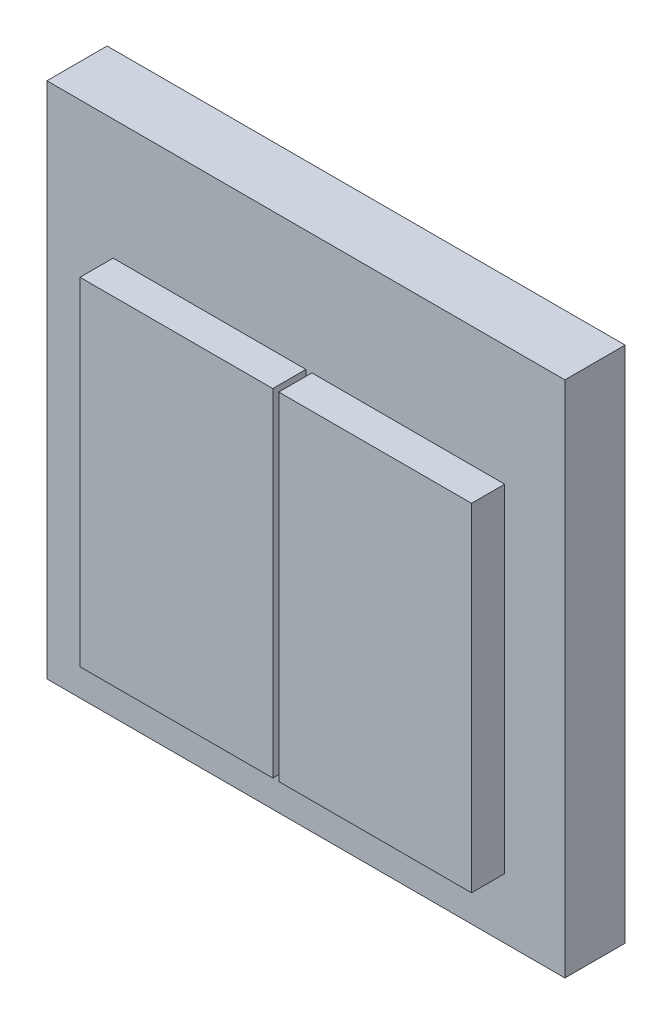
ISO-10303-21;
HEADER;
FILE_DESCRIPTION(('STEP AP214'),'2;1');
FILE_NAME('part.step','',(''),(''),'','','');
FILE_SCHEMA(('AUTOMOTIVE_DESIGN { 1 0 10303 214 1 1 1 1 }'));
ENDSEC;
DATA;
#1=APPLICATION_CONTEXT('core data for automotive mechanical design processes');
#2=APPLICATION_PROTOCOL_DEFINITION('international standard','automotive_design',2000,#1);
#3=PRODUCT_CONTEXT('',#1,'mechanical');
#4=PRODUCT('Part','Part','',(#3));
#5=PRODUCT_RELATED_PRODUCT_CATEGORY('part','',(#4));
#6=PRODUCT_DEFINITION_FORMATION('','',#4);
#7=PRODUCT_DEFINITION_CONTEXT('part definition',#1,'design');
#8=PRODUCT_DEFINITION('design','',#6,#7);
#9=PRODUCT_DEFINITION_SHAPE('','',#8);
#10=(LENGTH_UNIT() NAMED_UNIT(*) SI_UNIT(.MILLI.,.METRE.));
#11=(NAMED_UNIT(*) PLANE_ANGLE_UNIT() SI_UNIT($,.RADIAN.));
#12=(NAMED_UNIT(*) SI_UNIT($,.STERADIAN.) SOLID_ANGLE_UNIT());
#13=UNCERTAINTY_MEASURE_WITH_UNIT(LENGTH_MEASURE(1.E-05),#10,'distance_accuracy_value','');
#14=(GEOMETRIC_REPRESENTATION_CONTEXT(3) GLOBAL_UNCERTAINTY_ASSIGNED_CONTEXT((#13)) GLOBAL_UNIT_ASSIGNED_CONTEXT((#10,
#11,#12)) REPRESENTATION_CONTEXT('',''));
#15=CARTESIAN_POINT('',(0.,0.,0.));
#16=DIRECTION('',(0.,0.,1.));
#17=DIRECTION('',(1.,0.,0.));
#18=AXIS2_PLACEMENT_3D('',#15,#16,#17);
#19=CARTESIAN_POINT('',(0.,0.,0.));
#20=DIRECTION('',(0.,0.,1.));
#21=DIRECTION('',(1.,0.,0.));
#22=AXIS2_PLACEMENT_3D('',#19,#20,#21);
#23=PLANE('',#22);
#24=DIRECTION('',(0.,-1.,0.));
#25=VECTOR('',#24,1.);
#26=CARTESIAN_POINT('',(-43.,43.,0.));
#27=LINE('',#26,#25);
#28=CARTESIAN_POINT('',(-43.,43.,0.));
#29=VERTEX_POINT('',#28);
#30=CARTESIAN_POINT('',(-43.,-43.,0.));
#31=VERTEX_POINT('',#30);
#32=EDGE_CURVE('E179',#29,#31,#27,.T.);
#33=ORIENTED_EDGE('',*,*,#32,.T.);
#34=DIRECTION('',(1.,0.,0.));
#35=VECTOR('',#34,1.);
#36=CARTESIAN_POINT('',(-43.,-43.,0.));
#37=LINE('',#36,#35);
#38=CARTESIAN_POINT('',(43.,-43.,0.));
#39=VERTEX_POINT('',#38);
#40=EDGE_CURVE('E187',#31,#39,#37,.T.);
#41=ORIENTED_EDGE('',*,*,#40,.T.);
#42=DIRECTION('',(0.,1.,0.));
#43=VECTOR('',#42,1.);
#44=CARTESIAN_POINT('',(43.,43.,0.));
#45=LINE('',#44,#43);
#46=CARTESIAN_POINT('',(43.,43.,0.));
#47=VERTEX_POINT('',#46);
#48=EDGE_CURVE('E184',#39,#47,#45,.T.);
#49=ORIENTED_EDGE('',*,*,#48,.T.);
#50=DIRECTION('',(-1.,0.,0.));
#51=VECTOR('',#50,1.);
#52=CARTESIAN_POINT('',(-43.,43.,0.));
#53=LINE('',#52,#51);
#54=EDGE_CURVE('E180',#47,#29,#53,.T.);
#55=ORIENTED_EDGE('',*,*,#54,.T.);
#56=EDGE_LOOP('',(#33,#41,#49,#55));
#57=FACE_BOUND('',#56,.T.);
#58=DIRECTION('',(0.,-1.,0.));
#59=VECTOR('',#58,1.);
#60=CARTESIAN_POINT('',(-32.,-33.,0.));
#61=LINE('',#60,#59);
#62=CARTESIAN_POINT('',(-32.,23.,0.));
#63=VERTEX_POINT('',#62);
#64=CARTESIAN_POINT('',(-32.,-33.,0.));
#65=VERTEX_POINT('',#64);
#66=EDGE_CURVE('E151',#63,#65,#61,.T.);
#67=ORIENTED_EDGE('',*,*,#66,.F.);
#68=DIRECTION('',(-1.,0.,0.));
#69=VECTOR('',#68,1.);
#70=CARTESIAN_POINT('',(0.,23.,0.));
#71=LINE('',#70,#69);
#72=CARTESIAN_POINT('',(0.,23.,0.));
#73=VERTEX_POINT('',#72);
#74=EDGE_CURVE('E148',#73,#63,#71,.T.);
#75=ORIENTED_EDGE('',*,*,#74,.F.);
#76=DIRECTION('',(0.,1.,0.));
#77=VECTOR('',#76,1.);
#78=CARTESIAN_POINT('',(0.,23.,0.));
#79=LINE('',#78,#77);
#80=CARTESIAN_POINT('',(0.,-33.,0.));
#81=VERTEX_POINT('',#80);
#82=EDGE_CURVE('E160',#81,#73,#79,.T.);
#83=ORIENTED_EDGE('',*,*,#82,.F.);
#84=DIRECTION('',(1.,0.,0.));
#85=VECTOR('',#84,1.);
#86=CARTESIAN_POINT('',(0.,-33.,0.));
#87=LINE('',#86,#85);
#88=EDGE_CURVE('E168',#65,#81,#87,.T.);
#89=ORIENTED_EDGE('',*,*,#88,.F.);
#90=EDGE_LOOP('',(#67,#75,#83,#89));
#91=FACE_BOUND('',#90,.T.);
#92=DIRECTION('',(-1.,0.,0.));
#93=VECTOR('',#92,1.);
#94=CARTESIAN_POINT('',(33.,23.,0.));
#95=LINE('',#94,#93);
#96=CARTESIAN_POINT('',(33.,23.,0.));
#97=VERTEX_POINT('',#96);
#98=CARTESIAN_POINT('',(1.,23.,0.));
#99=VERTEX_POINT('',#98);
#100=EDGE_CURVE('E374',#97,#99,#95,.T.);
#101=ORIENTED_EDGE('',*,*,#100,.F.);
#102=DIRECTION('',(0.,1.,0.));
#103=VECTOR('',#102,1.);
#104=CARTESIAN_POINT('',(33.,-33.,0.));
#105=LINE('',#104,#103);
#106=CARTESIAN_POINT('',(33.,-33.,0.));
#107=VERTEX_POINT('',#106);
#108=EDGE_CURVE('E146',#107,#97,#105,.T.);
#109=ORIENTED_EDGE('',*,*,#108,.F.);
#110=DIRECTION('',(1.,0.,0.));
#111=VECTOR('',#110,1.);
#112=CARTESIAN_POINT('',(33.,-33.,0.));
#113=LINE('',#112,#111);
#114=CARTESIAN_POINT('',(1.,-33.,0.));
#115=VERTEX_POINT('',#114);
#116=EDGE_CURVE('E142',#115,#107,#113,.T.);
#117=ORIENTED_EDGE('',*,*,#116,.F.);
#118=DIRECTION('',(0.,-1.,0.));
#119=VECTOR('',#118,1.);
#120=CARTESIAN_POINT('',(1.,23.,0.));
#121=LINE('',#120,#119);
#122=EDGE_CURVE('E371',#99,#115,#121,.T.);
#123=ORIENTED_EDGE('',*,*,#122,.F.);
#124=EDGE_LOOP('',(#101,#109,#117,#123));
#125=FACE_BOUND('',#124,.T.);
#126=ADVANCED_FACE('F34',(#57,#91,#125),#23,.T.);
#127=CARTESIAN_POINT('',(0.,0.,-10.));
#128=DIRECTION('',(0.,0.,-1.));
#129=DIRECTION('',(-1.,0.,0.));
#130=AXIS2_PLACEMENT_3D('',#127,#128,#129);
#131=PLANE('',#130);
#132=DIRECTION('',(0.,-1.,0.));
#133=VECTOR('',#132,1.);
#134=CARTESIAN_POINT('',(-43.,43.,-9.99999999999999));
#135=LINE('',#134,#133);
#136=CARTESIAN_POINT('',(-43.,43.,-9.99999999999999));
#137=VERTEX_POINT('',#136);
#138=CARTESIAN_POINT('',(-43.,-43.,-9.99999999999999));
#139=VERTEX_POINT('',#138);
#140=EDGE_CURVE('E42',#137,#139,#135,.T.);
#141=ORIENTED_EDGE('',*,*,#140,.F.);
#142=DIRECTION('',(-1.,0.,0.));
#143=VECTOR('',#142,1.);
#144=CARTESIAN_POINT('',(-43.,43.,-9.99999999999999));
#145=LINE('',#144,#143);
#146=CARTESIAN_POINT('',(43.,43.,-9.99999999999999));
#147=VERTEX_POINT('',#146);
#148=EDGE_CURVE('E198',#147,#137,#145,.T.);
#149=ORIENTED_EDGE('',*,*,#148,.F.);
#150=DIRECTION('',(0.,1.,0.));
#151=VECTOR('',#150,1.);
#152=CARTESIAN_POINT('',(43.,43.,-9.99999999999999));
#153=LINE('',#152,#151);
#154=CARTESIAN_POINT('',(43.,-43.,-9.99999999999999));
#155=VERTEX_POINT('',#154);
#156=EDGE_CURVE('E202',#155,#147,#153,.T.);
#157=ORIENTED_EDGE('',*,*,#156,.F.);
#158=DIRECTION('',(1.,0.,0.));
#159=VECTOR('',#158,1.);
#160=CARTESIAN_POINT('',(-43.,-43.,-9.99999999999999));
#161=LINE('',#160,#159);
#162=EDGE_CURVE('E183',#139,#155,#161,.T.);
#163=ORIENTED_EDGE('',*,*,#162,.F.);
#164=EDGE_LOOP('',(#141,#149,#157,#163));
#165=FACE_BOUND('',#164,.T.);
#166=ADVANCED_FACE('F36',(#165),#131,.T.);
#167=CARTESIAN_POINT('',(-43.,-43.,-131.622366364086));
#168=DIRECTION('',(0.,-1.,0.));
#169=DIRECTION('',(0.,0.,-1.));
#170=AXIS2_PLACEMENT_3D('',#167,#168,#169);
#171=PLANE('',#170);
#172=DIRECTION('',(0.,0.,1.));
#173=VECTOR('',#172,1.);
#174=CARTESIAN_POINT('',(-43.,-43.,-131.622366364086));
#175=LINE('',#174,#173);
#176=EDGE_CURVE('E11',#139,#31,#175,.T.);
#177=ORIENTED_EDGE('',*,*,#176,.F.);
#178=ORIENTED_EDGE('',*,*,#162,.T.);
#179=DIRECTION('',(0.,0.,1.));
#180=VECTOR('',#179,1.);
#181=CARTESIAN_POINT('',(43.,-43.,-131.622366364086));
#182=LINE('',#181,#180);
#183=EDGE_CURVE('E194',#155,#39,#182,.T.);
#184=ORIENTED_EDGE('',*,*,#183,.T.);
#185=ORIENTED_EDGE('',*,*,#40,.F.);
#186=EDGE_LOOP('',(#177,#178,#184,#185));
#187=FACE_BOUND('',#186,.T.);
#188=ADVANCED_FACE('F211',(#187),#171,.T.);
#189=CARTESIAN_POINT('',(43.,43.,-131.622366364086));
#190=DIRECTION('',(1.,0.,0.));
#191=DIRECTION('',(0.,0.,-1.));
#192=AXIS2_PLACEMENT_3D('',#189,#190,#191);
#193=PLANE('',#192);
#194=ORIENTED_EDGE('',*,*,#183,.F.);
#195=ORIENTED_EDGE('',*,*,#156,.T.);
#196=DIRECTION('',(0.,0.,1.));
#197=VECTOR('',#196,1.);
#198=CARTESIAN_POINT('',(43.,43.,-131.622366364086));
#199=LINE('',#198,#197);
#200=EDGE_CURVE('E201',#147,#47,#199,.T.);
#201=ORIENTED_EDGE('',*,*,#200,.T.);
#202=ORIENTED_EDGE('',*,*,#48,.F.);
#203=EDGE_LOOP('',(#194,#195,#201,#202));
#204=FACE_BOUND('',#203,.T.);
#205=ADVANCED_FACE('F213',(#204),#193,.T.);
#206=CARTESIAN_POINT('',(-43.,43.,-131.622366364086));
#207=DIRECTION('',(0.,1.,0.));
#208=DIRECTION('',(0.,0.,1.));
#209=AXIS2_PLACEMENT_3D('',#206,#207,#208);
#210=PLANE('',#209);
#211=ORIENTED_EDGE('',*,*,#200,.F.);
#212=ORIENTED_EDGE('',*,*,#148,.T.);
#213=DIRECTION('',(0.,0.,1.));
#214=VECTOR('',#213,1.);
#215=CARTESIAN_POINT('',(-43.,43.,-131.622366364086));
#216=LINE('',#215,#214);
#217=EDGE_CURVE('E197',#137,#29,#216,.T.);
#218=ORIENTED_EDGE('',*,*,#217,.T.);
#219=ORIENTED_EDGE('',*,*,#54,.F.);
#220=EDGE_LOOP('',(#211,#212,#218,#219));
#221=FACE_BOUND('',#220,.T.);
#222=ADVANCED_FACE('F224',(#221),#210,.T.);
#223=CARTESIAN_POINT('',(-43.,43.,-131.622366364086));
#224=DIRECTION('',(-1.,0.,0.));
#225=DIRECTION('',(0.,0.,1.));
#226=AXIS2_PLACEMENT_3D('',#223,#224,#225);
#227=PLANE('',#226);
#228=ORIENTED_EDGE('',*,*,#217,.F.);
#229=ORIENTED_EDGE('',*,*,#140,.T.);
#230=ORIENTED_EDGE('',*,*,#176,.T.);
#231=ORIENTED_EDGE('',*,*,#32,.F.);
#232=EDGE_LOOP('',(#228,#229,#230,#231));
#233=FACE_BOUND('',#232,.T.);
#234=ADVANCED_FACE('F221',(#233),#227,.T.);
#235=CARTESIAN_POINT('',(0.,23.,5.5));
#236=DIRECTION('',(0.,-1.,0.));
#237=DIRECTION('',(1.,0.,0.));
#238=AXIS2_PLACEMENT_3D('',#235,#236,#237);
#239=PLANE('',#238);
#240=ORIENTED_EDGE('',*,*,#74,.T.);
#241=DIRECTION('',(0.,0.,-1.));
#242=VECTOR('',#241,1.);
#243=CARTESIAN_POINT('',(-32.,23.,5.5));
#244=LINE('',#243,#242);
#245=CARTESIAN_POINT('',(-32.,23.,5.5));
#246=VERTEX_POINT('',#245);
#247=EDGE_CURVE('E177',#246,#63,#244,.T.);
#248=ORIENTED_EDGE('',*,*,#247,.F.);
#249=DIRECTION('',(-1.,0.,0.));
#250=VECTOR('',#249,1.);
#251=CARTESIAN_POINT('',(0.,23.,5.5));
#252=LINE('',#251,#250);
#253=CARTESIAN_POINT('',(0.,23.,5.5));
#254=VERTEX_POINT('',#253);
#255=EDGE_CURVE('E156',#254,#246,#252,.T.);
#256=ORIENTED_EDGE('',*,*,#255,.F.);
#257=DIRECTION('',(0.,0.,-1.));
#258=VECTOR('',#257,1.);
#259=CARTESIAN_POINT('',(0.,23.,5.5));
#260=LINE('',#259,#258);
#261=EDGE_CURVE('E165',#254,#73,#260,.T.);
#262=ORIENTED_EDGE('',*,*,#261,.T.);
#263=EDGE_LOOP('',(#240,#248,#256,#262));
#264=FACE_BOUND('',#263,.T.);
#265=ADVANCED_FACE('F231',(#264),#239,.F.);
#266=CARTESIAN_POINT('',(-32.,-33.,5.5));
#267=DIRECTION('',(1.,0.,0.));
#268=DIRECTION('',(0.,0.,-1.));
#269=AXIS2_PLACEMENT_3D('',#266,#267,#268);
#270=PLANE('',#269);
#271=ORIENTED_EDGE('',*,*,#66,.T.);
#272=DIRECTION('',(0.,0.,-1.));
#273=VECTOR('',#272,1.);
#274=CARTESIAN_POINT('',(-32.,-33.,5.5));
#275=LINE('',#274,#273);
#276=CARTESIAN_POINT('',(-32.,-33.,5.5));
#277=VERTEX_POINT('',#276);
#278=EDGE_CURVE('E174',#277,#65,#275,.T.);
#279=ORIENTED_EDGE('',*,*,#278,.F.);
#280=DIRECTION('',(0.,-1.,0.));
#281=VECTOR('',#280,1.);
#282=CARTESIAN_POINT('',(-32.,-33.,5.5));
#283=LINE('',#282,#281);
#284=EDGE_CURVE('E159',#246,#277,#283,.T.);
#285=ORIENTED_EDGE('',*,*,#284,.F.);
#286=ORIENTED_EDGE('',*,*,#247,.T.);
#287=EDGE_LOOP('',(#271,#279,#285,#286));
#288=FACE_BOUND('',#287,.T.);
#289=ADVANCED_FACE('F242',(#288),#270,.F.);
#290=CARTESIAN_POINT('',(0.,-33.,5.5));
#291=DIRECTION('',(0.,1.,0.));
#292=DIRECTION('',(-1.,0.,0.));
#293=AXIS2_PLACEMENT_3D('',#290,#291,#292);
#294=PLANE('',#293);
#295=ORIENTED_EDGE('',*,*,#88,.T.);
#296=DIRECTION('',(0.,0.,-1.));
#297=VECTOR('',#296,1.);
#298=CARTESIAN_POINT('',(0.,-33.,5.5));
#299=LINE('',#298,#297);
#300=CARTESIAN_POINT('',(0.,-33.,5.5));
#301=VERTEX_POINT('',#300);
#302=EDGE_CURVE('E57',#301,#81,#299,.T.);
#303=ORIENTED_EDGE('',*,*,#302,.F.);
#304=DIRECTION('',(1.,0.,0.));
#305=VECTOR('',#304,1.);
#306=CARTESIAN_POINT('',(0.,-33.,5.5));
#307=LINE('',#306,#305);
#308=EDGE_CURVE('E162',#277,#301,#307,.T.);
#309=ORIENTED_EDGE('',*,*,#308,.F.);
#310=ORIENTED_EDGE('',*,*,#278,.T.);
#311=EDGE_LOOP('',(#295,#303,#309,#310));
#312=FACE_BOUND('',#311,.T.);
#313=ADVANCED_FACE('F246',(#312),#294,.F.);
#314=CARTESIAN_POINT('',(0.,23.,5.5));
#315=DIRECTION('',(-1.,0.,0.));
#316=DIRECTION('',(0.,0.,1.));
#317=AXIS2_PLACEMENT_3D('',#314,#315,#316);
#318=PLANE('',#317);
#319=ORIENTED_EDGE('',*,*,#82,.T.);
#320=ORIENTED_EDGE('',*,*,#261,.F.);
#321=DIRECTION('',(0.,1.,0.));
#322=VECTOR('',#321,1.);
#323=CARTESIAN_POINT('',(0.,23.,5.5));
#324=LINE('',#323,#322);
#325=EDGE_CURVE('E164',#301,#254,#324,.T.);
#326=ORIENTED_EDGE('',*,*,#325,.F.);
#327=ORIENTED_EDGE('',*,*,#302,.T.);
#328=EDGE_LOOP('',(#319,#320,#326,#327));
#329=FACE_BOUND('',#328,.T.);
#330=ADVANCED_FACE('F250',(#329),#318,.F.);
#331=CARTESIAN_POINT('',(0.,0.,5.5));
#332=DIRECTION('',(0.,0.,-1.));
#333=DIRECTION('',(-1.,0.,0.));
#334=AXIS2_PLACEMENT_3D('',#331,#332,#333);
#335=PLANE('',#334);
#336=ORIENTED_EDGE('',*,*,#255,.T.);
#337=ORIENTED_EDGE('',*,*,#284,.T.);
#338=ORIENTED_EDGE('',*,*,#308,.T.);
#339=ORIENTED_EDGE('',*,*,#325,.T.);
#340=EDGE_LOOP('',(#336,#337,#338,#339));
#341=FACE_BOUND('',#340,.T.);
#342=ADVANCED_FACE('F254',(#341),#335,.F.);
#343=CARTESIAN_POINT('',(33.,-33.,5.5));
#344=DIRECTION('',(-1.,0.,0.));
#345=DIRECTION('',(0.,0.,1.));
#346=AXIS2_PLACEMENT_3D('',#343,#344,#345);
#347=PLANE('',#346);
#348=ORIENTED_EDGE('',*,*,#108,.T.);
#349=DIRECTION('',(0.,0.,-1.));
#350=VECTOR('',#349,1.);
#351=CARTESIAN_POINT('',(33.,23.,5.5));
#352=LINE('',#351,#350);
#353=CARTESIAN_POINT('',(33.,23.,5.5));
#354=VERTEX_POINT('',#353);
#355=EDGE_CURVE('E127',#354,#97,#352,.T.);
#356=ORIENTED_EDGE('',*,*,#355,.F.);
#357=DIRECTION('',(0.,1.,0.));
#358=VECTOR('',#357,1.);
#359=CARTESIAN_POINT('',(33.,-33.,5.5));
#360=LINE('',#359,#358);
#361=CARTESIAN_POINT('',(33.,-33.,5.5));
#362=VERTEX_POINT('',#361);
#363=EDGE_CURVE('E134',#362,#354,#360,.T.);
#364=ORIENTED_EDGE('',*,*,#363,.F.);
#365=DIRECTION('',(0.,0.,-1.));
#366=VECTOR('',#365,1.);
#367=CARTESIAN_POINT('',(33.,-33.,5.5));
#368=LINE('',#367,#366);
#369=EDGE_CURVE('E368',#362,#107,#368,.T.);
#370=ORIENTED_EDGE('',*,*,#369,.T.);
#371=EDGE_LOOP('',(#348,#356,#364,#370));
#372=FACE_BOUND('',#371,.T.);
#373=ADVANCED_FACE('F144',(#372),#347,.F.);
#374=CARTESIAN_POINT('',(33.,23.,5.5));
#375=DIRECTION('',(0.,-1.,0.));
#376=DIRECTION('',(0.,0.,-1.));
#377=AXIS2_PLACEMENT_3D('',#374,#375,#376);
#378=PLANE('',#377);
#379=ORIENTED_EDGE('',*,*,#100,.T.);
#380=DIRECTION('',(0.,0.,-1.));
#381=VECTOR('',#380,1.);
#382=CARTESIAN_POINT('',(1.,23.,5.5));
#383=LINE('',#382,#381);
#384=CARTESIAN_POINT('',(1.,23.,5.5));
#385=VERTEX_POINT('',#384);
#386=EDGE_CURVE('E130',#385,#99,#383,.T.);
#387=ORIENTED_EDGE('',*,*,#386,.F.);
#388=DIRECTION('',(-1.,0.,0.));
#389=VECTOR('',#388,1.);
#390=CARTESIAN_POINT('',(33.,23.,5.5));
#391=LINE('',#390,#389);
#392=EDGE_CURVE('E123',#354,#385,#391,.T.);
#393=ORIENTED_EDGE('',*,*,#392,.F.);
#394=ORIENTED_EDGE('',*,*,#355,.T.);
#395=EDGE_LOOP('',(#379,#387,#393,#394));
#396=FACE_BOUND('',#395,.T.);
#397=ADVANCED_FACE('F125',(#396),#378,.F.);
#398=CARTESIAN_POINT('',(1.,23.,5.5));
#399=DIRECTION('',(1.,0.,0.));
#400=DIRECTION('',(0.,0.,-1.));
#401=AXIS2_PLACEMENT_3D('',#398,#399,#400);
#402=PLANE('',#401);
#403=ORIENTED_EDGE('',*,*,#122,.T.);
#404=DIRECTION('',(0.,0.,-1.));
#405=VECTOR('',#404,1.);
#406=CARTESIAN_POINT('',(1.,-33.,5.5));
#407=LINE('',#406,#405);
#408=CARTESIAN_POINT('',(1.,-33.,5.5));
#409=VERTEX_POINT('',#408);
#410=EDGE_CURVE('E49',#409,#115,#407,.T.);
#411=ORIENTED_EDGE('',*,*,#410,.F.);
#412=DIRECTION('',(0.,-1.,0.));
#413=VECTOR('',#412,1.);
#414=CARTESIAN_POINT('',(1.,23.,5.5));
#415=LINE('',#414,#413);
#416=EDGE_CURVE('E133',#385,#409,#415,.T.);
#417=ORIENTED_EDGE('',*,*,#416,.F.);
#418=ORIENTED_EDGE('',*,*,#386,.T.);
#419=EDGE_LOOP('',(#403,#411,#417,#418));
#420=FACE_BOUND('',#419,.T.);
#421=ADVANCED_FACE('F262',(#420),#402,.F.);
#422=CARTESIAN_POINT('',(33.,-33.,5.5));
#423=DIRECTION('',(0.,1.,0.));
#424=DIRECTION('',(0.,0.,1.));
#425=AXIS2_PLACEMENT_3D('',#422,#423,#424);
#426=PLANE('',#425);
#427=ORIENTED_EDGE('',*,*,#116,.T.);
#428=ORIENTED_EDGE('',*,*,#369,.F.);
#429=DIRECTION('',(1.,0.,0.));
#430=VECTOR('',#429,1.);
#431=CARTESIAN_POINT('',(33.,-33.,5.5));
#432=LINE('',#431,#430);
#433=EDGE_CURVE('E138',#409,#362,#432,.T.);
#434=ORIENTED_EDGE('',*,*,#433,.F.);
#435=ORIENTED_EDGE('',*,*,#410,.T.);
#436=EDGE_LOOP('',(#427,#428,#434,#435));
#437=FACE_BOUND('',#436,.T.);
#438=ADVANCED_FACE('F265',(#437),#426,.F.);
#439=CARTESIAN_POINT('',(0.,0.,5.5));
#440=DIRECTION('',(0.,0.,1.));
#441=DIRECTION('',(1.,0.,0.));
#442=AXIS2_PLACEMENT_3D('',#439,#440,#441);
#443=PLANE('',#442);
#444=ORIENTED_EDGE('',*,*,#363,.T.);
#445=ORIENTED_EDGE('',*,*,#392,.T.);
#446=ORIENTED_EDGE('',*,*,#416,.T.);
#447=ORIENTED_EDGE('',*,*,#433,.T.);
#448=EDGE_LOOP('',(#444,#445,#446,#447));
#449=FACE_BOUND('',#448,.T.);
#450=ADVANCED_FACE('F137',(#449),#443,.T.);
#451=CLOSED_SHELL('',(#126,#166,#188,#205,#222,#234,#265,#289,#313,#330,#342,#373,#397,#421,
#438,#450));
#452=MANIFOLD_SOLID_BREP('B2',#451);
#453=ADVANCED_BREP_SHAPE_REPRESENTATION('',(#18,#452),#14);
#454=SHAPE_DEFINITION_REPRESENTATION(#9,#453);
ENDSEC;
END-ISO-10303-21;
